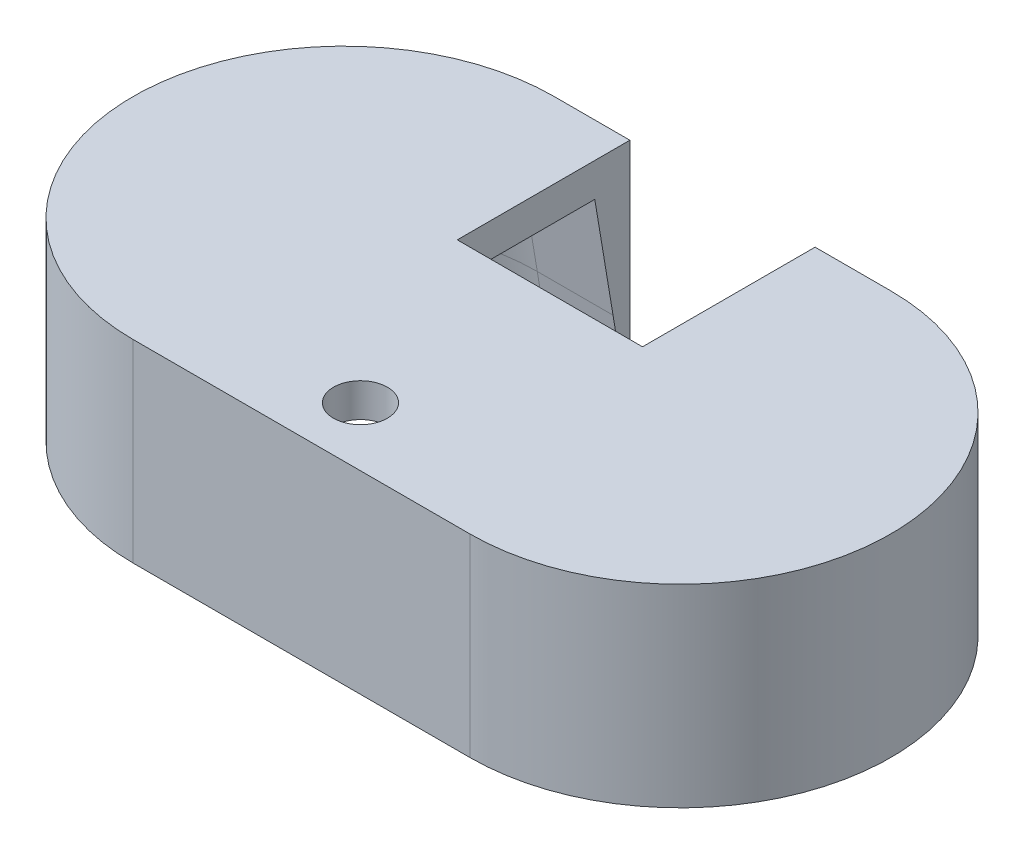
ISO-10303-21;
HEADER;
FILE_DESCRIPTION(('STEP AP214'),'2;1');
FILE_NAME('part.step','',(''),(''),'','','');
FILE_SCHEMA(('AUTOMOTIVE_DESIGN { 1 0 10303 214 1 1 1 1 }'));
ENDSEC;
DATA;
#1=APPLICATION_CONTEXT('core data for automotive mechanical design processes');
#2=APPLICATION_PROTOCOL_DEFINITION('international standard','automotive_design',2000,#1);
#3=PRODUCT_CONTEXT('',#1,'mechanical');
#4=PRODUCT('Part','Part','',(#3));
#5=PRODUCT_RELATED_PRODUCT_CATEGORY('part','',(#4));
#6=PRODUCT_DEFINITION_FORMATION('','',#4);
#7=PRODUCT_DEFINITION_CONTEXT('part definition',#1,'design');
#8=PRODUCT_DEFINITION('design','',#6,#7);
#9=PRODUCT_DEFINITION_SHAPE('','',#8);
#10=(LENGTH_UNIT() NAMED_UNIT(*) SI_UNIT(.MILLI.,.METRE.));
#11=(NAMED_UNIT(*) PLANE_ANGLE_UNIT() SI_UNIT($,.RADIAN.));
#12=(NAMED_UNIT(*) SI_UNIT($,.STERADIAN.) SOLID_ANGLE_UNIT());
#13=UNCERTAINTY_MEASURE_WITH_UNIT(LENGTH_MEASURE(1.E-05),#10,'distance_accuracy_value','');
#14=(GEOMETRIC_REPRESENTATION_CONTEXT(3) GLOBAL_UNCERTAINTY_ASSIGNED_CONTEXT((#13)) GLOBAL_UNIT_ASSIGNED_CONTEXT((#10,
#11,#12)) REPRESENTATION_CONTEXT('',''));
#15=CARTESIAN_POINT('',(0.,0.,0.));
#16=DIRECTION('',(0.,0.,1.));
#17=DIRECTION('',(1.,0.,0.));
#18=AXIS2_PLACEMENT_3D('',#15,#16,#17);
#19=CARTESIAN_POINT('',(0.,2.,-12.5));
#20=DIRECTION('',(0.,0.,1.));
#21=DIRECTION('',(1.,0.,0.));
#22=AXIS2_PLACEMENT_3D('',#19,#20,#21);
#23=PLANE('',#22);
#24=DIRECTION('',(-1.,0.,0.));
#25=VECTOR('',#24,1.);
#26=CARTESIAN_POINT('',(0.,2.,-12.5));
#27=LINE('',#26,#25);
#28=CARTESIAN_POINT('',(-5.5,2.,-12.5));
#29=VERTEX_POINT('',#28);
#30=CARTESIAN_POINT('',(-10.,2.,-12.5));
#31=VERTEX_POINT('',#30);
#32=EDGE_CURVE('E256',#29,#31,#27,.T.);
#33=ORIENTED_EDGE('',*,*,#32,.F.);
#34=DIRECTION('',(0.,1.,0.));
#35=VECTOR('',#34,1.);
#36=CARTESIAN_POINT('',(-5.5,-9.5,-12.5));
#37=LINE('',#36,#35);
#38=CARTESIAN_POINT('',(-5.5,-9.5,-12.5));
#39=VERTEX_POINT('',#38);
#40=EDGE_CURVE('E232',#39,#29,#37,.T.);
#41=ORIENTED_EDGE('',*,*,#40,.F.);
#42=DIRECTION('',(1.,0.,0.));
#43=VECTOR('',#42,1.);
#44=CARTESIAN_POINT('',(-10.,-9.5,-12.5));
#45=LINE('',#44,#43);
#46=CARTESIAN_POINT('',(-10.,-9.5,-12.5));
#47=VERTEX_POINT('',#46);
#48=EDGE_CURVE('E248',#47,#39,#45,.T.);
#49=ORIENTED_EDGE('',*,*,#48,.F.);
#50=DIRECTION('',(0.,-1.,0.));
#51=VECTOR('',#50,1.);
#52=CARTESIAN_POINT('',(-10.,2.,-12.5));
#53=LINE('',#52,#51);
#54=EDGE_CURVE('E265',#31,#47,#53,.T.);
#55=ORIENTED_EDGE('',*,*,#54,.F.);
#56=EDGE_LOOP('',(#33,#41,#49,#55));
#57=FACE_BOUND('',#56,.T.);
#58=ADVANCED_FACE('F40',(#57),#23,.F.);
#59=CARTESIAN_POINT('',(-10.,-6.49999999999998,-11.5));
#60=DIRECTION('',(0.,0.164398987305355,-0.986393923832144));
#61=DIRECTION('',(1.,0.,0.));
#62=AXIS2_PLACEMENT_3D('',#59,#60,#61);
#63=PLANE('',#62);
#64=DIRECTION('',(0.,0.986393923832144,0.164398987305355));
#65=VECTOR('',#64,1.);
#66=CARTESIAN_POINT('',(-5.5,-6.49999999999998,-11.5));
#67=LINE('',#66,#65);
#68=CARTESIAN_POINT('',(-5.5,-6.49999999999998,-11.5));
#69=VERTEX_POINT('',#68);
#70=CARTESIAN_POINT('',(-5.5,-9.5,-12.));
#71=VERTEX_POINT('',#70);
#72=EDGE_CURVE('E234',#69,#71,#67,.F.);
#73=ORIENTED_EDGE('',*,*,#72,.F.);
#74=DIRECTION('',(1.,0.,0.));
#75=VECTOR('',#74,1.);
#76=CARTESIAN_POINT('',(-10.,-6.49999999999998,-11.5));
#77=LINE('',#76,#75);
#78=CARTESIAN_POINT('',(-10.,-6.49999999999998,-11.5));
#79=VERTEX_POINT('',#78);
#80=EDGE_CURVE('E289',#79,#69,#77,.T.);
#81=ORIENTED_EDGE('',*,*,#80,.F.);
#82=DIRECTION('',(0.,-0.986393923832144,-0.164398987305355));
#83=VECTOR('',#82,1.);
#84=CARTESIAN_POINT('',(-10.,-6.49999999999998,-11.5));
#85=LINE('',#84,#83);
#86=CARTESIAN_POINT('',(-10.,-9.5,-12.));
#87=VERTEX_POINT('',#86);
#88=EDGE_CURVE('E241',#79,#87,#85,.T.);
#89=ORIENTED_EDGE('',*,*,#88,.T.);
#90=DIRECTION('',(-1.,0.,0.));
#91=VECTOR('',#90,1.);
#92=CARTESIAN_POINT('',(10.,-9.5,-12.));
#93=LINE('',#92,#91);
#94=EDGE_CURVE('E277',#71,#87,#93,.T.);
#95=ORIENTED_EDGE('',*,*,#94,.F.);
#96=EDGE_LOOP('',(#73,#81,#89,#95));
#97=FACE_BOUND('',#96,.T.);
#98=ADVANCED_FACE('F331',(#97),#63,.F.);
#99=CARTESIAN_POINT('',(0.,0.,-10.416667));
#100=DIRECTION('',(0.,0.164398938088199,-0.986393932035002));
#101=DIRECTION('',(1.,0.,0.));
#102=AXIS2_PLACEMENT_3D('',#99,#100,#101);
#103=PLANE('',#102);
#104=ORIENTED_EDGE('',*,*,#80,.T.);
#105=DIRECTION('',(0.,0.986393932035002,0.164398938088199));
#106=VECTOR('',#105,1.);
#107=CARTESIAN_POINT('',(-5.5,0.,-10.416667));
#108=LINE('',#107,#106);
#109=CARTESIAN_POINT('',(-5.5,0.,-10.416667));
#110=VERTEX_POINT('',#109);
#111=EDGE_CURVE('E203',#69,#110,#108,.T.);
#112=ORIENTED_EDGE('',*,*,#111,.T.);
#113=DIRECTION('',(1.,0.,0.));
#114=VECTOR('',#113,1.);
#115=CARTESIAN_POINT('',(0.,0.,-10.416667));
#116=LINE('',#115,#114);
#117=CARTESIAN_POINT('',(-10.,0.,-10.416667));
#118=VERTEX_POINT('',#117);
#119=EDGE_CURVE('E181',#118,#110,#116,.T.);
#120=ORIENTED_EDGE('',*,*,#119,.F.);
#121=DIRECTION('',(0.,-0.986393932035002,-0.164398938088199));
#122=VECTOR('',#121,1.);
#123=CARTESIAN_POINT('',(-10.,0.,-10.416667));
#124=LINE('',#123,#122);
#125=EDGE_CURVE('E198',#118,#79,#124,.T.);
#126=ORIENTED_EDGE('',*,*,#125,.T.);
#127=EDGE_LOOP('',(#104,#112,#120,#126));
#128=FACE_BOUND('',#127,.T.);
#129=ADVANCED_FACE('F325',(#128),#103,.F.);
#130=CARTESIAN_POINT('',(0.,2.,12.5));
#131=DIRECTION('',(0.,0.,1.));
#132=DIRECTION('',(1.,0.,0.));
#133=AXIS2_PLACEMENT_3D('',#130,#131,#132);
#134=PLANE('',#133);
#135=DIRECTION('',(0.,-1.,0.));
#136=VECTOR('',#135,1.);
#137=CARTESIAN_POINT('',(-9.99999999999997,2.,12.5));
#138=LINE('',#137,#136);
#139=CARTESIAN_POINT('',(-9.99999999999997,2.,12.5));
#140=VERTEX_POINT('',#139);
#141=CARTESIAN_POINT('',(-9.99999999999997,-9.5,12.5));
#142=VERTEX_POINT('',#141);
#143=EDGE_CURVE('E263',#140,#142,#138,.T.);
#144=ORIENTED_EDGE('',*,*,#143,.T.);
#145=DIRECTION('',(-1.,0.,0.));
#146=VECTOR('',#145,1.);
#147=CARTESIAN_POINT('',(10.,-9.5,12.5));
#148=LINE('',#147,#146);
#149=CARTESIAN_POINT('',(10.,-9.5,12.5));
#150=VERTEX_POINT('',#149);
#151=EDGE_CURVE('E240',#150,#142,#148,.T.);
#152=ORIENTED_EDGE('',*,*,#151,.F.);
#153=DIRECTION('',(0.,-1.,0.));
#154=VECTOR('',#153,1.);
#155=CARTESIAN_POINT('',(10.,2.,12.5));
#156=LINE('',#155,#154);
#157=CARTESIAN_POINT('',(10.,2.,12.5));
#158=VERTEX_POINT('',#157);
#159=EDGE_CURVE('E270',#158,#150,#156,.T.);
#160=ORIENTED_EDGE('',*,*,#159,.F.);
#161=DIRECTION('',(-1.,0.,0.));
#162=VECTOR('',#161,1.);
#163=CARTESIAN_POINT('',(0.,2.,12.5));
#164=LINE('',#163,#162);
#165=EDGE_CURVE('E251',#158,#140,#164,.T.);
#166=ORIENTED_EDGE('',*,*,#165,.T.);
#167=EDGE_LOOP('',(#144,#152,#160,#166));
#168=FACE_BOUND('',#167,.T.);
#169=ADVANCED_FACE('F367',(#168),#134,.T.);
#170=CARTESIAN_POINT('',(10.,2.,0.));
#171=DIRECTION('',(0.,-1.,0.));
#172=DIRECTION('',(0.,0.,-1.));
#173=AXIS2_PLACEMENT_3D('',#170,#171,#172);
#174=CYLINDRICAL_SURFACE('',#173,12.5);
#175=ORIENTED_EDGE('',*,*,#159,.T.);
#176=CARTESIAN_POINT('',(10.,-9.5,0.));
#177=DIRECTION('',(0.,-1.,0.));
#178=DIRECTION('',(0.,0.,-1.));
#179=AXIS2_PLACEMENT_3D('',#176,#177,#178);
#180=CIRCLE('',#179,12.5);
#181=CARTESIAN_POINT('',(10.,-9.5,-12.5));
#182=VERTEX_POINT('',#181);
#183=EDGE_CURVE('E237',#182,#150,#180,.T.);
#184=ORIENTED_EDGE('',*,*,#183,.F.);
#185=DIRECTION('',(0.,-1.,0.));
#186=VECTOR('',#185,1.);
#187=CARTESIAN_POINT('',(10.,2.,-12.5));
#188=LINE('',#187,#186);
#189=CARTESIAN_POINT('',(10.,2.,-12.5));
#190=VERTEX_POINT('',#189);
#191=EDGE_CURVE('E267',#190,#182,#188,.T.);
#192=ORIENTED_EDGE('',*,*,#191,.F.);
#193=CARTESIAN_POINT('',(10.,2.,0.));
#194=DIRECTION('',(0.,1.,0.));
#195=DIRECTION('',(0.,0.,1.));
#196=AXIS2_PLACEMENT_3D('',#193,#194,#195);
#197=CIRCLE('',#196,12.5);
#198=EDGE_CURVE('E254',#158,#190,#197,.T.);
#199=ORIENTED_EDGE('',*,*,#198,.F.);
#200=EDGE_LOOP('',(#175,#184,#192,#199));
#201=FACE_BOUND('',#200,.T.);
#202=ADVANCED_FACE('F359',(#201),#174,.T.);
#203=CARTESIAN_POINT('',(5.5,-9.5,-12.5));
#204=VERTEX_POINT('',#203);
#205=EDGE_CURVE('E247',#204,#182,#45,.T.);
#206=ORIENTED_EDGE('',*,*,#205,.F.);
#207=DIRECTION('',(0.,1.,0.));
#208=VECTOR('',#207,1.);
#209=CARTESIAN_POINT('',(5.5,-9.5,-12.5));
#210=LINE('',#209,#208);
#211=CARTESIAN_POINT('',(5.5,2.,-12.5));
#212=VERTEX_POINT('',#211);
#213=EDGE_CURVE('E224',#204,#212,#210,.T.);
#214=ORIENTED_EDGE('',*,*,#213,.T.);
#215=EDGE_CURVE('E257',#190,#212,#27,.T.);
#216=ORIENTED_EDGE('',*,*,#215,.F.);
#217=ORIENTED_EDGE('',*,*,#191,.T.);
#218=EDGE_LOOP('',(#206,#214,#216,#217));
#219=FACE_BOUND('',#218,.T.);
#220=ADVANCED_FACE('F350',(#219),#23,.F.);
#221=CARTESIAN_POINT('',(-10.,2.,0.));
#222=DIRECTION('',(0.,-1.,0.));
#223=DIRECTION('',(0.,0.,-1.));
#224=AXIS2_PLACEMENT_3D('',#221,#222,#223);
#225=CYLINDRICAL_SURFACE('',#224,12.5);
#226=ORIENTED_EDGE('',*,*,#54,.T.);
#227=CARTESIAN_POINT('',(-10.,-9.5,0.));
#228=DIRECTION('',(0.,-1.,0.));
#229=DIRECTION('',(0.,0.,-1.));
#230=AXIS2_PLACEMENT_3D('',#227,#228,#229);
#231=CIRCLE('',#230,12.5);
#232=EDGE_CURVE('E244',#142,#47,#231,.T.);
#233=ORIENTED_EDGE('',*,*,#232,.F.);
#234=ORIENTED_EDGE('',*,*,#143,.F.);
#235=CARTESIAN_POINT('',(-10.,2.,0.));
#236=DIRECTION('',(0.,1.,0.));
#237=DIRECTION('',(0.,0.,1.));
#238=AXIS2_PLACEMENT_3D('',#235,#236,#237);
#239=CIRCLE('',#238,12.5);
#240=EDGE_CURVE('E260',#140,#31,#239,.F.);
#241=ORIENTED_EDGE('',*,*,#240,.T.);
#242=EDGE_LOOP('',(#226,#233,#234,#241));
#243=FACE_BOUND('',#242,.T.);
#244=ADVANCED_FACE('F358',(#243),#225,.T.);
#245=CARTESIAN_POINT('',(0.,2.,0.));
#246=DIRECTION('',(0.,1.,0.));
#247=DIRECTION('',(0.,0.,1.));
#248=AXIS2_PLACEMENT_3D('',#245,#246,#247);
#249=PLANE('',#248);
#250=CARTESIAN_POINT('',(0.,2.,9.));
#251=DIRECTION('',(0.,1.,0.));
#252=DIRECTION('',(0.,0.,1.));
#253=AXIS2_PLACEMENT_3D('',#250,#251,#252);
#254=CIRCLE('',#253,1.6);
#255=CARTESIAN_POINT('',(0.,2.,10.6));
#256=VERTEX_POINT('',#255);
#257=EDGE_CURVE('E174',#256,#256,#254,.T.);
#258=ORIENTED_EDGE('',*,*,#257,.F.);
#259=EDGE_LOOP('',(#258));
#260=FACE_BOUND('',#259,.T.);
#261=DIRECTION('',(0.,0.,1.));
#262=VECTOR('',#261,1.);
#263=CARTESIAN_POINT('',(-5.5,2.,-12.5));
#264=LINE('',#263,#262);
#265=CARTESIAN_POINT('',(-5.5,2.,-2.25));
#266=VERTEX_POINT('',#265);
#267=EDGE_CURVE('E173',#29,#266,#264,.T.);
#268=ORIENTED_EDGE('',*,*,#267,.F.);
#269=ORIENTED_EDGE('',*,*,#32,.T.);
#270=ORIENTED_EDGE('',*,*,#240,.F.);
#271=ORIENTED_EDGE('',*,*,#165,.F.);
#272=ORIENTED_EDGE('',*,*,#198,.T.);
#273=ORIENTED_EDGE('',*,*,#215,.T.);
#274=DIRECTION('',(0.,0.,-1.));
#275=VECTOR('',#274,1.);
#276=CARTESIAN_POINT('',(5.5,2.,-12.5));
#277=LINE('',#276,#275);
#278=CARTESIAN_POINT('',(5.5,2.,-2.25));
#279=VERTEX_POINT('',#278);
#280=EDGE_CURVE('E412',#279,#212,#277,.T.);
#281=ORIENTED_EDGE('',*,*,#280,.F.);
#282=DIRECTION('',(1.,0.,0.));
#283=VECTOR('',#282,1.);
#284=CARTESIAN_POINT('',(-5.5,2.,-2.25));
#285=LINE('',#284,#283);
#286=EDGE_CURVE('E414',#266,#279,#285,.T.);
#287=ORIENTED_EDGE('',*,*,#286,.F.);
#288=EDGE_LOOP('',(#268,#269,#270,#271,#272,#273,#281,#287));
#289=FACE_BOUND('',#288,.T.);
#290=ADVANCED_FACE('F365',(#260,#289),#249,.T.);
#291=CARTESIAN_POINT('',(10.,-9.5,0.));
#292=DIRECTION('',(0.,-1.,0.));
#293=DIRECTION('',(0.,0.,-1.));
#294=AXIS2_PLACEMENT_3D('',#291,#292,#293);
#295=PLANE('',#294);
#296=DIRECTION('',(0.,0.,1.));
#297=VECTOR('',#296,1.);
#298=CARTESIAN_POINT('',(-5.5,-9.5,-12.5));
#299=LINE('',#298,#297);
#300=EDGE_CURVE('E227',#39,#71,#299,.T.);
#301=ORIENTED_EDGE('',*,*,#300,.T.);
#302=ORIENTED_EDGE('',*,*,#94,.T.);
#303=CARTESIAN_POINT('',(-10.,-9.5,0.));
#304=DIRECTION('',(0.,-1.,0.));
#305=DIRECTION('',(0.,0.,-1.));
#306=AXIS2_PLACEMENT_3D('',#303,#304,#305);
#307=CIRCLE('',#306,12.);
#308=CARTESIAN_POINT('',(-9.99999999999997,-9.5,12.));
#309=VERTEX_POINT('',#308);
#310=EDGE_CURVE('E275',#87,#309,#307,.F.);
#311=ORIENTED_EDGE('',*,*,#310,.T.);
#312=DIRECTION('',(1.,0.,0.));
#313=VECTOR('',#312,1.);
#314=CARTESIAN_POINT('',(9.99999999999999,-9.5,12.));
#315=LINE('',#314,#313);
#316=CARTESIAN_POINT('',(10.,-9.5,12.));
#317=VERTEX_POINT('',#316);
#318=EDGE_CURVE('E281',#309,#317,#315,.T.);
#319=ORIENTED_EDGE('',*,*,#318,.T.);
#320=CARTESIAN_POINT('',(10.,-9.5,0.));
#321=DIRECTION('',(0.,-1.,0.));
#322=DIRECTION('',(0.,0.,-1.));
#323=AXIS2_PLACEMENT_3D('',#320,#321,#322);
#324=CIRCLE('',#323,12.);
#325=CARTESIAN_POINT('',(10.,-9.5,-12.));
#326=VERTEX_POINT('',#325);
#327=EDGE_CURVE('E283',#317,#326,#324,.F.);
#328=ORIENTED_EDGE('',*,*,#327,.T.);
#329=CARTESIAN_POINT('',(5.5,-9.5,-12.));
#330=VERTEX_POINT('',#329);
#331=EDGE_CURVE('E278',#326,#330,#93,.T.);
#332=ORIENTED_EDGE('',*,*,#331,.T.);
#333=DIRECTION('',(0.,0.,-1.));
#334=VECTOR('',#333,1.);
#335=CARTESIAN_POINT('',(5.5,-9.5,-12.5));
#336=LINE('',#335,#334);
#337=EDGE_CURVE('E222',#330,#204,#336,.T.);
#338=ORIENTED_EDGE('',*,*,#337,.T.);
#339=ORIENTED_EDGE('',*,*,#205,.T.);
#340=ORIENTED_EDGE('',*,*,#183,.T.);
#341=ORIENTED_EDGE('',*,*,#151,.T.);
#342=ORIENTED_EDGE('',*,*,#232,.T.);
#343=ORIENTED_EDGE('',*,*,#48,.T.);
#344=EDGE_LOOP('',(#301,#302,#311,#319,#328,#332,#338,#339,#340,#341,#342,#343));
#345=FACE_BOUND('',#344,.T.);
#346=ADVANCED_FACE('F333',(#345),#295,.T.);
#347=CARTESIAN_POINT('',(0.,0.,0.));
#348=DIRECTION('',(0.,1.,0.));
#349=DIRECTION('',(0.,0.,1.));
#350=AXIS2_PLACEMENT_3D('',#347,#348,#349);
#351=PLANE('',#350);
#352=DIRECTION('',(-1.,0.,0.));
#353=VECTOR('',#352,1.);
#354=CARTESIAN_POINT('',(0.,0.,10.416667));
#355=LINE('',#354,#353);
#356=CARTESIAN_POINT('',(10.,0.,10.416667));
#357=VERTEX_POINT('',#356);
#358=CARTESIAN_POINT('',(0.74367641559419,0.,10.416667));
#359=VERTEX_POINT('',#358);
#360=EDGE_CURVE('E172',#357,#359,#355,.T.);
#361=ORIENTED_EDGE('',*,*,#360,.T.);
#362=CARTESIAN_POINT('',(0.,0.,9.));
#363=DIRECTION('',(0.,1.,0.));
#364=DIRECTION('',(0.,0.,1.));
#365=AXIS2_PLACEMENT_3D('',#362,#363,#364);
#366=CIRCLE('',#365,1.6);
#367=CARTESIAN_POINT('',(-0.743676415594192,0.,10.416667));
#368=VERTEX_POINT('',#367);
#369=EDGE_CURVE('E55',#359,#368,#366,.T.);
#370=ORIENTED_EDGE('',*,*,#369,.T.);
#371=CARTESIAN_POINT('',(-9.99999999999997,0.,10.416667));
#372=VERTEX_POINT('',#371);
#373=EDGE_CURVE('E169',#368,#372,#355,.T.);
#374=ORIENTED_EDGE('',*,*,#373,.T.);
#375=CARTESIAN_POINT('',(-10.,0.,0.));
#376=DIRECTION('',(0.,1.,0.));
#377=DIRECTION('',(0.,0.,1.));
#378=AXIS2_PLACEMENT_3D('',#375,#376,#377);
#379=CIRCLE('',#378,10.416667);
#380=EDGE_CURVE('E295',#372,#118,#379,.F.);
#381=ORIENTED_EDGE('',*,*,#380,.T.);
#382=ORIENTED_EDGE('',*,*,#119,.T.);
#383=DIRECTION('',(0.,0.,1.));
#384=VECTOR('',#383,1.);
#385=CARTESIAN_POINT('',(-5.5,0.,0.));
#386=LINE('',#385,#384);
#387=CARTESIAN_POINT('',(-5.5,0.,-2.25));
#388=VERTEX_POINT('',#387);
#389=EDGE_CURVE('E194',#110,#388,#386,.T.);
#390=ORIENTED_EDGE('',*,*,#389,.T.);
#391=DIRECTION('',(1.,0.,0.));
#392=VECTOR('',#391,1.);
#393=CARTESIAN_POINT('',(0.,0.,-2.25));
#394=LINE('',#393,#392);
#395=CARTESIAN_POINT('',(5.5,0.,-2.25));
#396=VERTEX_POINT('',#395);
#397=EDGE_CURVE('E49',#388,#396,#394,.T.);
#398=ORIENTED_EDGE('',*,*,#397,.T.);
#399=DIRECTION('',(0.,0.,-1.));
#400=VECTOR('',#399,1.);
#401=CARTESIAN_POINT('',(5.5,0.,0.));
#402=LINE('',#401,#400);
#403=CARTESIAN_POINT('',(5.5,0.,-10.416667));
#404=VERTEX_POINT('',#403);
#405=EDGE_CURVE('E208',#396,#404,#402,.T.);
#406=ORIENTED_EDGE('',*,*,#405,.T.);
#407=CARTESIAN_POINT('',(10.,0.,-10.416667));
#408=VERTEX_POINT('',#407);
#409=EDGE_CURVE('E185',#404,#408,#116,.T.);
#410=ORIENTED_EDGE('',*,*,#409,.T.);
#411=CARTESIAN_POINT('',(10.,0.,0.));
#412=DIRECTION('',(0.,1.,0.));
#413=DIRECTION('',(0.,0.,1.));
#414=AXIS2_PLACEMENT_3D('',#411,#412,#413);
#415=CIRCLE('',#414,10.416667);
#416=EDGE_CURVE('E183',#408,#357,#415,.F.);
#417=ORIENTED_EDGE('',*,*,#416,.T.);
#418=EDGE_LOOP('',(#361,#370,#374,#381,#382,#390,#398,#406,#410,#417));
#419=FACE_BOUND('',#418,.T.);
#420=ADVANCED_FACE('F168',(#419),#351,.F.);
#421=CARTESIAN_POINT('',(-10.,-6.49999999999998,0.));
#422=DIRECTION('',(0.,-1.,0.));
#423=DIRECTION('',(0.,0.,-1.));
#424=AXIS2_PLACEMENT_3D('',#421,#422,#423);
#425=CONICAL_SURFACE('',#424,11.5,0.165148677414625);
#426=DIRECTION('',(0.,0.986393923832144,-0.164398987305355));
#427=VECTOR('',#426,1.);
#428=CARTESIAN_POINT('',(-9.99999999999997,-9.5,12.));
#429=LINE('',#428,#427);
#430=CARTESIAN_POINT('',(-9.99999999999997,-6.49999999999998,11.5));
#431=VERTEX_POINT('',#430);
#432=EDGE_CURVE('E299',#309,#431,#429,.T.);
#433=ORIENTED_EDGE('',*,*,#432,.F.);
#434=ORIENTED_EDGE('',*,*,#310,.F.);
#435=ORIENTED_EDGE('',*,*,#88,.F.);
#436=CARTESIAN_POINT('',(-10.,-6.49999999999998,0.));
#437=DIRECTION('',(0.,-1.,0.));
#438=DIRECTION('',(0.,0.,-1.));
#439=AXIS2_PLACEMENT_3D('',#436,#437,#438);
#440=CIRCLE('',#439,11.5);
#441=EDGE_CURVE('E292',#431,#79,#440,.T.);
#442=ORIENTED_EDGE('',*,*,#441,.F.);
#443=EDGE_LOOP('',(#433,#434,#435,#442));
#444=FACE_BOUND('',#443,.T.);
#445=ADVANCED_FACE('F334',(#444),#425,.F.);
#446=DIRECTION('',(0.,-0.986393923832144,-0.164398987305355));
#447=VECTOR('',#446,1.);
#448=CARTESIAN_POINT('',(5.5,-6.49999999999998,-11.5));
#449=LINE('',#448,#447);
#450=CARTESIAN_POINT('',(5.5,-6.49999999999998,-11.5));
#451=VERTEX_POINT('',#450);
#452=EDGE_CURVE('E62',#330,#451,#449,.F.);
#453=ORIENTED_EDGE('',*,*,#452,.F.);
#454=ORIENTED_EDGE('',*,*,#331,.F.);
#455=DIRECTION('',(0.,-0.986393923832144,-0.164398987305355));
#456=VECTOR('',#455,1.);
#457=CARTESIAN_POINT('',(10.,-6.49999999999998,-11.5));
#458=LINE('',#457,#456);
#459=CARTESIAN_POINT('',(10.,-6.49999999999998,-11.5));
#460=VERTEX_POINT('',#459);
#461=EDGE_CURVE('E297',#460,#326,#458,.T.);
#462=ORIENTED_EDGE('',*,*,#461,.F.);
#463=EDGE_CURVE('E288',#451,#460,#77,.T.);
#464=ORIENTED_EDGE('',*,*,#463,.F.);
#465=EDGE_LOOP('',(#453,#454,#462,#464));
#466=FACE_BOUND('',#465,.T.);
#467=ADVANCED_FACE('F336',(#466),#63,.F.);
#468=CARTESIAN_POINT('',(10.,-6.49999999999998,11.5));
#469=DIRECTION('',(0.,0.164398987305355,0.986393923832144));
#470=DIRECTION('',(-1.,0.,0.));
#471=AXIS2_PLACEMENT_3D('',#468,#469,#470);
#472=PLANE('',#471);
#473=ORIENTED_EDGE('',*,*,#432,.T.);
#474=DIRECTION('',(-1.,0.,0.));
#475=VECTOR('',#474,1.);
#476=CARTESIAN_POINT('',(10.,-6.49999999999998,11.5));
#477=LINE('',#476,#475);
#478=CARTESIAN_POINT('',(10.,-6.49999999999998,11.5));
#479=VERTEX_POINT('',#478);
#480=EDGE_CURVE('E286',#479,#431,#477,.T.);
#481=ORIENTED_EDGE('',*,*,#480,.F.);
#482=DIRECTION('',(0.,0.986393923832144,-0.164398987305355));
#483=VECTOR('',#482,1.);
#484=CARTESIAN_POINT('',(10.,-9.5,12.));
#485=LINE('',#484,#483);
#486=EDGE_CURVE('E201',#317,#479,#485,.T.);
#487=ORIENTED_EDGE('',*,*,#486,.F.);
#488=ORIENTED_EDGE('',*,*,#318,.F.);
#489=EDGE_LOOP('',(#473,#481,#487,#488));
#490=FACE_BOUND('',#489,.T.);
#491=ADVANCED_FACE('F317',(#490),#472,.F.);
#492=CARTESIAN_POINT('',(10.,-6.49999999999998,0.));
#493=DIRECTION('',(0.,-1.,0.));
#494=DIRECTION('',(0.,0.,-1.));
#495=AXIS2_PLACEMENT_3D('',#492,#493,#494);
#496=CONICAL_SURFACE('',#495,11.5,0.165148677414625);
#497=ORIENTED_EDGE('',*,*,#461,.T.);
#498=ORIENTED_EDGE('',*,*,#327,.F.);
#499=ORIENTED_EDGE('',*,*,#486,.T.);
#500=CARTESIAN_POINT('',(10.,-6.49999999999998,0.));
#501=DIRECTION('',(0.,-1.,0.));
#502=DIRECTION('',(0.,0.,-1.));
#503=AXIS2_PLACEMENT_3D('',#500,#501,#502);
#504=CIRCLE('',#503,11.5);
#505=EDGE_CURVE('E272',#460,#479,#504,.T.);
#506=ORIENTED_EDGE('',*,*,#505,.F.);
#507=EDGE_LOOP('',(#497,#498,#499,#506));
#508=FACE_BOUND('',#507,.T.);
#509=ADVANCED_FACE('F378',(#508),#496,.F.);
#510=CARTESIAN_POINT('',(-10.,0.,0.));
#511=DIRECTION('',(0.,-1.,0.));
#512=DIRECTION('',(0.,0.,-1.));
#513=AXIS2_PLACEMENT_3D('',#510,#511,#512);
#514=CONICAL_SURFACE('',#513,10.416667,0.16514862751858);
#515=DIRECTION('',(0.,0.986393932035002,-0.164398938088199));
#516=VECTOR('',#515,1.);
#517=CARTESIAN_POINT('',(-9.99999999999997,-6.4999999999999,11.5));
#518=LINE('',#517,#516);
#519=EDGE_CURVE('E180',#431,#372,#518,.T.);
#520=ORIENTED_EDGE('',*,*,#519,.F.);
#521=ORIENTED_EDGE('',*,*,#441,.T.);
#522=ORIENTED_EDGE('',*,*,#125,.F.);
#523=ORIENTED_EDGE('',*,*,#380,.F.);
#524=EDGE_LOOP('',(#520,#521,#522,#523));
#525=FACE_BOUND('',#524,.T.);
#526=ADVANCED_FACE('F43',(#525),#514,.F.);
#527=ORIENTED_EDGE('',*,*,#409,.F.);
#528=DIRECTION('',(0.,-0.986393932035002,-0.164398938088199));
#529=VECTOR('',#528,1.);
#530=CARTESIAN_POINT('',(5.5,0.,-10.416667));
#531=LINE('',#530,#529);
#532=EDGE_CURVE('E190',#404,#451,#531,.T.);
#533=ORIENTED_EDGE('',*,*,#532,.T.);
#534=ORIENTED_EDGE('',*,*,#463,.T.);
#535=DIRECTION('',(0.,-0.986393932035002,-0.164398938088199));
#536=VECTOR('',#535,1.);
#537=CARTESIAN_POINT('',(10.,0.,-10.416667));
#538=LINE('',#537,#536);
#539=EDGE_CURVE('E193',#408,#460,#538,.T.);
#540=ORIENTED_EDGE('',*,*,#539,.F.);
#541=EDGE_LOOP('',(#527,#533,#534,#540));
#542=FACE_BOUND('',#541,.T.);
#543=ADVANCED_FACE('F307',(#542),#103,.F.);
#544=CARTESIAN_POINT('',(0.,0.,10.416667));
#545=DIRECTION('',(0.,0.164398938088199,0.986393932035002));
#546=DIRECTION('',(-1.,0.,0.));
#547=AXIS2_PLACEMENT_3D('',#544,#545,#546);
#548=PLANE('',#547);
#549=ORIENTED_EDGE('',*,*,#373,.F.);
#550=CARTESIAN_POINT('',(0.,8.50000461538584,9.));
#551=DIRECTION('',(0.,0.164398938088199,0.986393932035002));
#552=DIRECTION('',(0.,0.986393932035002,-0.164398938088199));
#553=AXIS2_PLACEMENT_3D('',#550,#551,#552);
#554=ELLIPSE('',#553,9.73242296213379,1.6);
#555=EDGE_CURVE('E11',#368,#359,#554,.T.);
#556=ORIENTED_EDGE('',*,*,#555,.T.);
#557=ORIENTED_EDGE('',*,*,#360,.F.);
#558=DIRECTION('',(0.,0.986393932035002,-0.164398938088199));
#559=VECTOR('',#558,1.);
#560=CARTESIAN_POINT('',(10.,-6.49999999999989,11.5));
#561=LINE('',#560,#559);
#562=EDGE_CURVE('E191',#479,#357,#561,.T.);
#563=ORIENTED_EDGE('',*,*,#562,.F.);
#564=ORIENTED_EDGE('',*,*,#480,.T.);
#565=ORIENTED_EDGE('',*,*,#519,.T.);
#566=EDGE_LOOP('',(#549,#556,#557,#563,#564,#565));
#567=FACE_BOUND('',#566,.T.);
#568=ADVANCED_FACE('F177',(#567),#548,.F.);
#569=CARTESIAN_POINT('',(10.,0.,0.));
#570=DIRECTION('',(0.,-1.,0.));
#571=DIRECTION('',(0.,0.,-1.));
#572=AXIS2_PLACEMENT_3D('',#569,#570,#571);
#573=CONICAL_SURFACE('',#572,10.416667,0.16514862751858);
#574=ORIENTED_EDGE('',*,*,#539,.T.);
#575=ORIENTED_EDGE('',*,*,#505,.T.);
#576=ORIENTED_EDGE('',*,*,#562,.T.);
#577=ORIENTED_EDGE('',*,*,#416,.F.);
#578=EDGE_LOOP('',(#574,#575,#576,#577));
#579=FACE_BOUND('',#578,.T.);
#580=ADVANCED_FACE('F311',(#579),#573,.F.);
#581=CARTESIAN_POINT('',(-5.5,-9.5,-2.25));
#582=DIRECTION('',(0.,0.,1.));
#583=DIRECTION('',(1.,0.,0.));
#584=AXIS2_PLACEMENT_3D('',#581,#582,#583);
#585=PLANE('',#584);
#586=DIRECTION('',(0.,1.,0.));
#587=VECTOR('',#586,1.);
#588=CARTESIAN_POINT('',(-5.5,-9.5,-2.25));
#589=LINE('',#588,#587);
#590=EDGE_CURVE('E215',#388,#266,#589,.T.);
#591=ORIENTED_EDGE('',*,*,#590,.T.);
#592=ORIENTED_EDGE('',*,*,#286,.T.);
#593=DIRECTION('',(0.,1.,0.));
#594=VECTOR('',#593,1.);
#595=CARTESIAN_POINT('',(5.5,-9.5,-2.25));
#596=LINE('',#595,#594);
#597=EDGE_CURVE('E217',#396,#279,#596,.T.);
#598=ORIENTED_EDGE('',*,*,#597,.F.);
#599=ORIENTED_EDGE('',*,*,#397,.F.);
#600=EDGE_LOOP('',(#591,#592,#598,#599));
#601=FACE_BOUND('',#600,.T.);
#602=ADVANCED_FACE('F213',(#601),#585,.F.);
#603=CARTESIAN_POINT('',(-5.5,-9.5,-12.5));
#604=DIRECTION('',(-1.,0.,0.));
#605=DIRECTION('',(0.,0.,1.));
#606=AXIS2_PLACEMENT_3D('',#603,#604,#605);
#607=PLANE('',#606);
#608=ORIENTED_EDGE('',*,*,#111,.F.);
#609=ORIENTED_EDGE('',*,*,#72,.T.);
#610=ORIENTED_EDGE('',*,*,#300,.F.);
#611=ORIENTED_EDGE('',*,*,#40,.T.);
#612=ORIENTED_EDGE('',*,*,#267,.T.);
#613=ORIENTED_EDGE('',*,*,#590,.F.);
#614=ORIENTED_EDGE('',*,*,#389,.F.);
#615=EDGE_LOOP('',(#608,#609,#610,#611,#612,#613,#614));
#616=FACE_BOUND('',#615,.T.);
#617=ADVANCED_FACE('F219',(#616),#607,.F.);
#618=CARTESIAN_POINT('',(5.5,-9.5,-12.5));
#619=DIRECTION('',(1.,0.,0.));
#620=DIRECTION('',(0.,0.,-1.));
#621=AXIS2_PLACEMENT_3D('',#618,#619,#620);
#622=PLANE('',#621);
#623=ORIENTED_EDGE('',*,*,#597,.T.);
#624=ORIENTED_EDGE('',*,*,#280,.T.);
#625=ORIENTED_EDGE('',*,*,#213,.F.);
#626=ORIENTED_EDGE('',*,*,#337,.F.);
#627=ORIENTED_EDGE('',*,*,#452,.T.);
#628=ORIENTED_EDGE('',*,*,#532,.F.);
#629=ORIENTED_EDGE('',*,*,#405,.F.);
#630=EDGE_LOOP('',(#623,#624,#625,#626,#627,#628,#629));
#631=FACE_BOUND('',#630,.T.);
#632=ADVANCED_FACE('F375',(#631),#622,.F.);
#633=CARTESIAN_POINT('',(0.,-9.5,9.));
#634=DIRECTION('',(0.,1.,0.));
#635=DIRECTION('',(0.,0.,1.));
#636=AXIS2_PLACEMENT_3D('',#633,#634,#635);
#637=CYLINDRICAL_SURFACE('',#636,1.6);
#638=ORIENTED_EDGE('',*,*,#257,.T.);
#639=EDGE_LOOP('',(#638));
#640=FACE_BOUND('',#639,.T.);
#641=ORIENTED_EDGE('',*,*,#555,.F.);
#642=ORIENTED_EDGE('',*,*,#369,.F.);
#643=EDGE_LOOP('',(#641,#642));
#644=FACE_BOUND('',#643,.T.);
#645=ADVANCED_FACE('F162',(#640,#644),#637,.F.);
#646=CLOSED_SHELL('',(#58,#98,#129,#169,#202,#220,#244,#290,#346,#420,#445,#467,#491,#509,#526,
#543,#568,#580,#602,#617,#632,#645));
#647=MANIFOLD_SOLID_BREP('B2',#646);
#648=ADVANCED_BREP_SHAPE_REPRESENTATION('',(#18,#647),#14);
#649=SHAPE_DEFINITION_REPRESENTATION(#9,#648);
ENDSEC;
END-ISO-10303-21;
